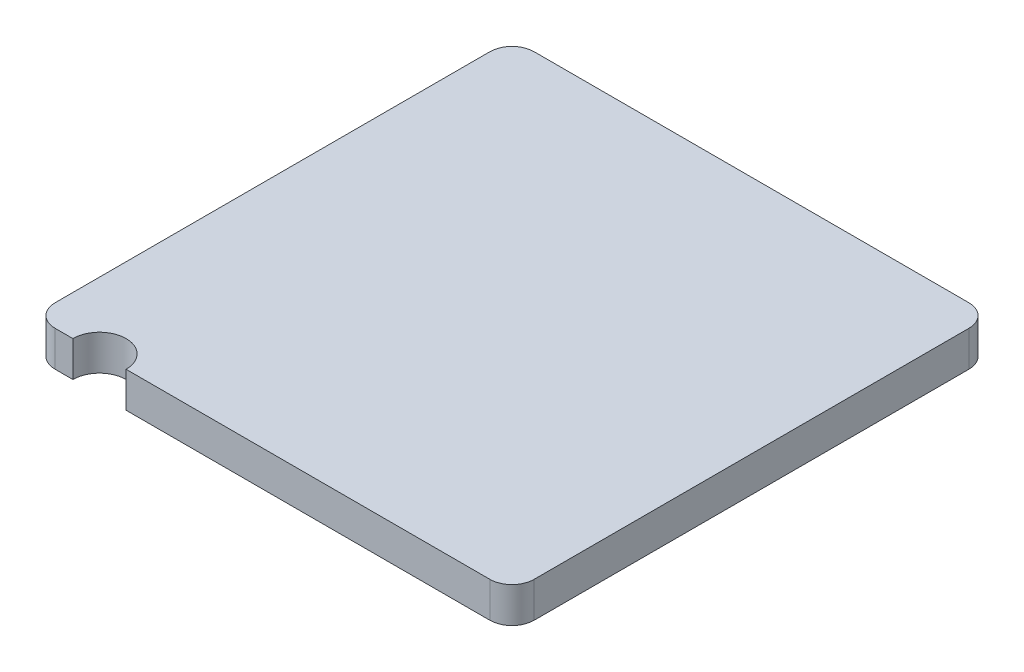
ISO-10303-21;
HEADER;
FILE_DESCRIPTION(('STEP AP214'),'2;1');
FILE_NAME('part.step','',(''),(''),'','','');
FILE_SCHEMA(('AUTOMOTIVE_DESIGN { 1 0 10303 214 1 1 1 1 }'));
ENDSEC;
DATA;
#1=APPLICATION_CONTEXT('core data for automotive mechanical design processes');
#2=APPLICATION_PROTOCOL_DEFINITION('international standard','automotive_design',2000,#1);
#3=PRODUCT_CONTEXT('',#1,'mechanical');
#4=PRODUCT('Part','Part','',(#3));
#5=PRODUCT_RELATED_PRODUCT_CATEGORY('part','',(#4));
#6=PRODUCT_DEFINITION_FORMATION('','',#4);
#7=PRODUCT_DEFINITION_CONTEXT('part definition',#1,'design');
#8=PRODUCT_DEFINITION('design','',#6,#7);
#9=PRODUCT_DEFINITION_SHAPE('','',#8);
#10=(LENGTH_UNIT() NAMED_UNIT(*) SI_UNIT(.MILLI.,.METRE.));
#11=(NAMED_UNIT(*) PLANE_ANGLE_UNIT() SI_UNIT($,.RADIAN.));
#12=(NAMED_UNIT(*) SI_UNIT($,.STERADIAN.) SOLID_ANGLE_UNIT());
#13=UNCERTAINTY_MEASURE_WITH_UNIT(LENGTH_MEASURE(1.E-05),#10,'distance_accuracy_value','');
#14=(GEOMETRIC_REPRESENTATION_CONTEXT(3) GLOBAL_UNCERTAINTY_ASSIGNED_CONTEXT((#13)) GLOBAL_UNIT_ASSIGNED_CONTEXT((#10,
#11,#12)) REPRESENTATION_CONTEXT('',''));
#15=CARTESIAN_POINT('',(0.,0.,0.));
#16=DIRECTION('',(0.,0.,1.));
#17=DIRECTION('',(1.,0.,0.));
#18=AXIS2_PLACEMENT_3D('',#15,#16,#17);
#19=CARTESIAN_POINT('',(-1.35,0.2,1.35));
#20=DIRECTION('',(0.,0.,-1.));
#21=DIRECTION('',(-1.,0.,0.));
#22=AXIS2_PLACEMENT_3D('',#19,#20,#21);
#23=PLANE('',#22);
#24=DIRECTION('',(1.,0.,0.));
#25=VECTOR('',#24,1.);
#26=CARTESIAN_POINT('',(-1.35,0.2,1.35));
#27=LINE('',#26,#25);
#28=CARTESIAN_POINT('',(-0.825,0.2,1.35));
#29=VERTEX_POINT('',#28);
#30=CARTESIAN_POINT('',(1.225,0.2,1.35));
#31=VERTEX_POINT('',#30);
#32=EDGE_CURVE('E57',#29,#31,#27,.T.);
#33=ORIENTED_EDGE('',*,*,#32,.F.);
#34=DIRECTION('',(0.,-1.,0.));
#35=VECTOR('',#34,1.);
#36=CARTESIAN_POINT('',(-0.825,0.2,1.35));
#37=LINE('',#36,#35);
#38=CARTESIAN_POINT('',(-0.825,0.,1.35));
#39=VERTEX_POINT('',#38);
#40=EDGE_CURVE('E109',#29,#39,#37,.T.);
#41=ORIENTED_EDGE('',*,*,#40,.T.);
#42=DIRECTION('',(1.,0.,0.));
#43=VECTOR('',#42,1.);
#44=CARTESIAN_POINT('',(-1.35,0.,1.35));
#45=LINE('',#44,#43);
#46=CARTESIAN_POINT('',(1.225,0.,1.35));
#47=VERTEX_POINT('',#46);
#48=EDGE_CURVE('E140',#39,#47,#45,.T.);
#49=ORIENTED_EDGE('',*,*,#48,.T.);
#50=DIRECTION('',(0.,-1.,0.));
#51=VECTOR('',#50,1.);
#52=CARTESIAN_POINT('',(1.225,0.2,1.35));
#53=LINE('',#52,#51);
#54=EDGE_CURVE('E11',#47,#31,#53,.F.);
#55=ORIENTED_EDGE('',*,*,#54,.T.);
#56=EDGE_LOOP('',(#33,#41,#49,#55));
#57=FACE_BOUND('',#56,.T.);
#58=ADVANCED_FACE('F34',(#57),#23,.F.);
#59=CARTESIAN_POINT('',(1.35,0.2,1.35));
#60=DIRECTION('',(-1.,0.,0.));
#61=DIRECTION('',(0.,0.,1.));
#62=AXIS2_PLACEMENT_3D('',#59,#60,#61);
#63=PLANE('',#62);
#64=DIRECTION('',(0.,0.,-1.));
#65=VECTOR('',#64,1.);
#66=CARTESIAN_POINT('',(1.35,0.,1.35));
#67=LINE('',#66,#65);
#68=CARTESIAN_POINT('',(1.35,0.,1.225));
#69=VERTEX_POINT('',#68);
#70=CARTESIAN_POINT('',(1.35,0.,-1.225));
#71=VERTEX_POINT('',#70);
#72=EDGE_CURVE('E131',#69,#71,#67,.T.);
#73=ORIENTED_EDGE('',*,*,#72,.T.);
#74=DIRECTION('',(0.,-1.,0.));
#75=VECTOR('',#74,1.);
#76=CARTESIAN_POINT('',(1.35,0.2,-1.225));
#77=LINE('',#76,#75);
#78=CARTESIAN_POINT('',(1.35,0.2,-1.225));
#79=VERTEX_POINT('',#78);
#80=EDGE_CURVE('E174',#71,#79,#77,.F.);
#81=ORIENTED_EDGE('',*,*,#80,.T.);
#82=DIRECTION('',(0.,0.,-1.));
#83=VECTOR('',#82,1.);
#84=CARTESIAN_POINT('',(1.35,0.2,1.35));
#85=LINE('',#84,#83);
#86=CARTESIAN_POINT('',(1.35,0.2,1.225));
#87=VERTEX_POINT('',#86);
#88=EDGE_CURVE('E144',#87,#79,#85,.T.);
#89=ORIENTED_EDGE('',*,*,#88,.F.);
#90=DIRECTION('',(0.,-1.,0.));
#91=VECTOR('',#90,1.);
#92=CARTESIAN_POINT('',(1.35,0.2,1.225));
#93=LINE('',#92,#91);
#94=EDGE_CURVE('E171',#87,#69,#93,.T.);
#95=ORIENTED_EDGE('',*,*,#94,.T.);
#96=EDGE_LOOP('',(#73,#81,#89,#95));
#97=FACE_BOUND('',#96,.T.);
#98=ADVANCED_FACE('F210',(#97),#63,.F.);
#99=CARTESIAN_POINT('',(-1.35,0.2,-1.35));
#100=DIRECTION('',(0.,0.,1.));
#101=DIRECTION('',(1.,0.,0.));
#102=AXIS2_PLACEMENT_3D('',#99,#100,#101);
#103=PLANE('',#102);
#104=DIRECTION('',(-1.,0.,0.));
#105=VECTOR('',#104,1.);
#106=CARTESIAN_POINT('',(-1.35,0.,-1.35));
#107=LINE('',#106,#105);
#108=CARTESIAN_POINT('',(1.225,0.,-1.35));
#109=VERTEX_POINT('',#108);
#110=CARTESIAN_POINT('',(-1.225,0.,-1.35));
#111=VERTEX_POINT('',#110);
#112=EDGE_CURVE('E134',#109,#111,#107,.T.);
#113=ORIENTED_EDGE('',*,*,#112,.T.);
#114=DIRECTION('',(0.,-1.,0.));
#115=VECTOR('',#114,1.);
#116=CARTESIAN_POINT('',(-1.225,0.2,-1.35));
#117=LINE('',#116,#115);
#118=CARTESIAN_POINT('',(-1.225,0.2,-1.35));
#119=VERTEX_POINT('',#118);
#120=EDGE_CURVE('E161',#111,#119,#117,.F.);
#121=ORIENTED_EDGE('',*,*,#120,.T.);
#122=DIRECTION('',(-1.,0.,0.));
#123=VECTOR('',#122,1.);
#124=CARTESIAN_POINT('',(-1.35,0.2,-1.35));
#125=LINE('',#124,#123);
#126=CARTESIAN_POINT('',(1.225,0.2,-1.35));
#127=VERTEX_POINT('',#126);
#128=EDGE_CURVE('E127',#127,#119,#125,.T.);
#129=ORIENTED_EDGE('',*,*,#128,.F.);
#130=DIRECTION('',(0.,-1.,0.));
#131=VECTOR('',#130,1.);
#132=CARTESIAN_POINT('',(1.225,0.2,-1.35));
#133=LINE('',#132,#131);
#134=EDGE_CURVE('E158',#127,#109,#133,.T.);
#135=ORIENTED_EDGE('',*,*,#134,.T.);
#136=EDGE_LOOP('',(#113,#121,#129,#135));
#137=FACE_BOUND('',#136,.T.);
#138=ADVANCED_FACE('F204',(#137),#103,.F.);
#139=CARTESIAN_POINT('',(-1.35,0.2,1.35));
#140=DIRECTION('',(1.,0.,0.));
#141=DIRECTION('',(0.,0.,-1.));
#142=AXIS2_PLACEMENT_3D('',#139,#140,#141);
#143=PLANE('',#142);
#144=DIRECTION('',(0.,0.,1.));
#145=VECTOR('',#144,1.);
#146=CARTESIAN_POINT('',(-1.35,0.2,1.35));
#147=LINE('',#146,#145);
#148=CARTESIAN_POINT('',(-1.35,0.2,-1.225));
#149=VERTEX_POINT('',#148);
#150=CARTESIAN_POINT('',(-1.35,0.2,1.225));
#151=VERTEX_POINT('',#150);
#152=EDGE_CURVE('E123',#149,#151,#147,.T.);
#153=ORIENTED_EDGE('',*,*,#152,.F.);
#154=DIRECTION('',(0.,-1.,0.));
#155=VECTOR('',#154,1.);
#156=CARTESIAN_POINT('',(-1.35,0.2,-1.225));
#157=LINE('',#156,#155);
#158=CARTESIAN_POINT('',(-1.35,0.,-1.225));
#159=VERTEX_POINT('',#158);
#160=EDGE_CURVE('E146',#149,#159,#157,.T.);
#161=ORIENTED_EDGE('',*,*,#160,.T.);
#162=DIRECTION('',(0.,0.,1.));
#163=VECTOR('',#162,1.);
#164=CARTESIAN_POINT('',(-1.35,0.,1.35));
#165=LINE('',#164,#163);
#166=CARTESIAN_POINT('',(-1.35,0.,1.225));
#167=VERTEX_POINT('',#166);
#168=EDGE_CURVE('E137',#159,#167,#165,.T.);
#169=ORIENTED_EDGE('',*,*,#168,.T.);
#170=DIRECTION('',(0.,-1.,0.));
#171=VECTOR('',#170,1.);
#172=CARTESIAN_POINT('',(-1.35,0.2,1.225));
#173=LINE('',#172,#171);
#174=EDGE_CURVE('E125',#167,#151,#173,.F.);
#175=ORIENTED_EDGE('',*,*,#174,.T.);
#176=EDGE_LOOP('',(#153,#161,#169,#175));
#177=FACE_BOUND('',#176,.T.);
#178=ADVANCED_FACE('F201',(#177),#143,.F.);
#179=CARTESIAN_POINT('',(-1.225,0.,1.35));
#180=VERTEX_POINT('',#179);
#181=CARTESIAN_POINT('',(-1.125,0.,1.35));
#182=VERTEX_POINT('',#181);
#183=EDGE_CURVE('E141',#180,#182,#45,.T.);
#184=ORIENTED_EDGE('',*,*,#183,.T.);
#185=DIRECTION('',(0.,-1.,0.));
#186=VECTOR('',#185,1.);
#187=CARTESIAN_POINT('',(-1.125,0.2,1.35));
#188=LINE('',#187,#186);
#189=CARTESIAN_POINT('',(-1.125,0.2,1.35));
#190=VERTEX_POINT('',#189);
#191=EDGE_CURVE('E49',#190,#182,#188,.T.);
#192=ORIENTED_EDGE('',*,*,#191,.F.);
#193=CARTESIAN_POINT('',(-1.225,0.2,1.35));
#194=VERTEX_POINT('',#193);
#195=EDGE_CURVE('E119',#194,#190,#27,.T.);
#196=ORIENTED_EDGE('',*,*,#195,.F.);
#197=DIRECTION('',(0.,-1.,0.));
#198=VECTOR('',#197,1.);
#199=CARTESIAN_POINT('',(-1.225,0.2,1.35));
#200=LINE('',#199,#198);
#201=EDGE_CURVE('E42',#194,#180,#200,.T.);
#202=ORIENTED_EDGE('',*,*,#201,.T.);
#203=EDGE_LOOP('',(#184,#192,#196,#202));
#204=FACE_BOUND('',#203,.T.);
#205=ADVANCED_FACE('F179',(#204),#23,.F.);
#206=CARTESIAN_POINT('',(0.,0.2,0.));
#207=DIRECTION('',(0.,-1.,0.));
#208=DIRECTION('',(0.,0.,-1.));
#209=AXIS2_PLACEMENT_3D('',#206,#207,#208);
#210=PLANE('',#209);
#211=ORIENTED_EDGE('',*,*,#195,.T.);
#212=CARTESIAN_POINT('',(-0.975,0.2,1.35));
#213=DIRECTION('',(0.,-1.,0.));
#214=DIRECTION('',(0.,0.,-1.));
#215=AXIS2_PLACEMENT_3D('',#212,#213,#214);
#216=CIRCLE('',#215,0.15);
#217=EDGE_CURVE('E111',#190,#29,#216,.T.);
#218=ORIENTED_EDGE('',*,*,#217,.T.);
#219=ORIENTED_EDGE('',*,*,#32,.T.);
#220=CARTESIAN_POINT('',(1.225,0.2,1.225));
#221=DIRECTION('',(0.,-1.,0.));
#222=DIRECTION('',(0.,0.,-1.));
#223=AXIS2_PLACEMENT_3D('',#220,#221,#222);
#224=CIRCLE('',#223,0.125);
#225=EDGE_CURVE('E165',#31,#87,#224,.F.);
#226=ORIENTED_EDGE('',*,*,#225,.T.);
#227=ORIENTED_EDGE('',*,*,#88,.T.);
#228=CARTESIAN_POINT('',(1.225,0.2,-1.225));
#229=DIRECTION('',(0.,-1.,0.));
#230=DIRECTION('',(0.,0.,-1.));
#231=AXIS2_PLACEMENT_3D('',#228,#229,#230);
#232=CIRCLE('',#231,0.125);
#233=EDGE_CURVE('E167',#79,#127,#232,.F.);
#234=ORIENTED_EDGE('',*,*,#233,.T.);
#235=ORIENTED_EDGE('',*,*,#128,.T.);
#236=CARTESIAN_POINT('',(-1.225,0.2,-1.225));
#237=DIRECTION('',(0.,-1.,0.));
#238=DIRECTION('',(0.,0.,-1.));
#239=AXIS2_PLACEMENT_3D('',#236,#237,#238);
#240=CIRCLE('',#239,0.125);
#241=EDGE_CURVE('E169',#119,#149,#240,.F.);
#242=ORIENTED_EDGE('',*,*,#241,.T.);
#243=ORIENTED_EDGE('',*,*,#152,.T.);
#244=CARTESIAN_POINT('',(-1.225,0.2,1.225));
#245=DIRECTION('',(0.,-1.,0.));
#246=DIRECTION('',(0.,0.,-1.));
#247=AXIS2_PLACEMENT_3D('',#244,#245,#246);
#248=CIRCLE('',#247,0.125);
#249=EDGE_CURVE('E163',#151,#194,#248,.F.);
#250=ORIENTED_EDGE('',*,*,#249,.T.);
#251=EDGE_LOOP('',(#211,#218,#219,#226,#227,#234,#235,#242,#243,#250));
#252=FACE_BOUND('',#251,.T.);
#253=ADVANCED_FACE('F117',(#252),#210,.F.);
#254=CARTESIAN_POINT('',(0.,0.,0.));
#255=DIRECTION('',(0.,-1.,0.));
#256=DIRECTION('',(0.,0.,-1.));
#257=AXIS2_PLACEMENT_3D('',#254,#255,#256);
#258=PLANE('',#257);
#259=CARTESIAN_POINT('',(-0.975,0.,1.35));
#260=DIRECTION('',(0.,-1.,0.));
#261=DIRECTION('',(0.,0.,-1.));
#262=AXIS2_PLACEMENT_3D('',#259,#260,#261);
#263=CIRCLE('',#262,0.15);
#264=EDGE_CURVE('E112',#182,#39,#263,.T.);
#265=ORIENTED_EDGE('',*,*,#264,.F.);
#266=ORIENTED_EDGE('',*,*,#183,.F.);
#267=CARTESIAN_POINT('',(-1.225,0.,1.225));
#268=DIRECTION('',(0.,-1.,0.));
#269=DIRECTION('',(0.,0.,-1.));
#270=AXIS2_PLACEMENT_3D('',#267,#268,#269);
#271=CIRCLE('',#270,0.125);
#272=EDGE_CURVE('E149',#180,#167,#271,.T.);
#273=ORIENTED_EDGE('',*,*,#272,.T.);
#274=ORIENTED_EDGE('',*,*,#168,.F.);
#275=CARTESIAN_POINT('',(-1.225,0.,-1.225));
#276=DIRECTION('',(0.,-1.,0.));
#277=DIRECTION('',(0.,0.,-1.));
#278=AXIS2_PLACEMENT_3D('',#275,#276,#277);
#279=CIRCLE('',#278,0.125);
#280=EDGE_CURVE('E156',#159,#111,#279,.T.);
#281=ORIENTED_EDGE('',*,*,#280,.T.);
#282=ORIENTED_EDGE('',*,*,#112,.F.);
#283=CARTESIAN_POINT('',(1.225,0.,-1.225));
#284=DIRECTION('',(0.,-1.,0.));
#285=DIRECTION('',(0.,0.,-1.));
#286=AXIS2_PLACEMENT_3D('',#283,#284,#285);
#287=CIRCLE('',#286,0.125);
#288=EDGE_CURVE('E154',#109,#71,#287,.T.);
#289=ORIENTED_EDGE('',*,*,#288,.T.);
#290=ORIENTED_EDGE('',*,*,#72,.F.);
#291=CARTESIAN_POINT('',(1.225,0.,1.225));
#292=DIRECTION('',(0.,-1.,0.));
#293=DIRECTION('',(0.,0.,-1.));
#294=AXIS2_PLACEMENT_3D('',#291,#292,#293);
#295=CIRCLE('',#294,0.125);
#296=EDGE_CURVE('E151',#69,#47,#295,.T.);
#297=ORIENTED_EDGE('',*,*,#296,.T.);
#298=ORIENTED_EDGE('',*,*,#48,.F.);
#299=EDGE_LOOP('',(#265,#266,#273,#274,#281,#282,#289,#290,#297,#298));
#300=FACE_BOUND('',#299,.T.);
#301=ADVANCED_FACE('F183',(#300),#258,.T.);
#302=CARTESIAN_POINT('',(-1.225,0.2,-1.225));
#303=DIRECTION('',(0.,-1.,0.));
#304=DIRECTION('',(0.,0.,-1.));
#305=AXIS2_PLACEMENT_3D('',#302,#303,#304);
#306=CYLINDRICAL_SURFACE('',#305,0.125);
#307=ORIENTED_EDGE('',*,*,#241,.F.);
#308=ORIENTED_EDGE('',*,*,#120,.F.);
#309=ORIENTED_EDGE('',*,*,#280,.F.);
#310=ORIENTED_EDGE('',*,*,#160,.F.);
#311=EDGE_LOOP('',(#307,#308,#309,#310));
#312=FACE_BOUND('',#311,.T.);
#313=ADVANCED_FACE('F199',(#312),#306,.T.);
#314=CARTESIAN_POINT('',(1.225,0.2,-1.225));
#315=DIRECTION('',(0.,-1.,0.));
#316=DIRECTION('',(0.,0.,-1.));
#317=AXIS2_PLACEMENT_3D('',#314,#315,#316);
#318=CYLINDRICAL_SURFACE('',#317,0.125);
#319=ORIENTED_EDGE('',*,*,#233,.F.);
#320=ORIENTED_EDGE('',*,*,#80,.F.);
#321=ORIENTED_EDGE('',*,*,#288,.F.);
#322=ORIENTED_EDGE('',*,*,#134,.F.);
#323=EDGE_LOOP('',(#319,#320,#321,#322));
#324=FACE_BOUND('',#323,.T.);
#325=ADVANCED_FACE('F206',(#324),#318,.T.);
#326=CARTESIAN_POINT('',(1.225,0.2,1.225));
#327=DIRECTION('',(0.,-1.,0.));
#328=DIRECTION('',(0.,0.,-1.));
#329=AXIS2_PLACEMENT_3D('',#326,#327,#328);
#330=CYLINDRICAL_SURFACE('',#329,0.125);
#331=ORIENTED_EDGE('',*,*,#225,.F.);
#332=ORIENTED_EDGE('',*,*,#54,.F.);
#333=ORIENTED_EDGE('',*,*,#296,.F.);
#334=ORIENTED_EDGE('',*,*,#94,.F.);
#335=EDGE_LOOP('',(#331,#332,#333,#334));
#336=FACE_BOUND('',#335,.T.);
#337=ADVANCED_FACE('F214',(#336),#330,.T.);
#338=CARTESIAN_POINT('',(-1.225,0.2,1.225));
#339=DIRECTION('',(0.,-1.,0.));
#340=DIRECTION('',(0.,0.,-1.));
#341=AXIS2_PLACEMENT_3D('',#338,#339,#340);
#342=CYLINDRICAL_SURFACE('',#341,0.125);
#343=ORIENTED_EDGE('',*,*,#249,.F.);
#344=ORIENTED_EDGE('',*,*,#174,.F.);
#345=ORIENTED_EDGE('',*,*,#272,.F.);
#346=ORIENTED_EDGE('',*,*,#201,.F.);
#347=EDGE_LOOP('',(#343,#344,#345,#346));
#348=FACE_BOUND('',#347,.T.);
#349=ADVANCED_FACE('F36',(#348),#342,.T.);
#350=CARTESIAN_POINT('',(-0.975,0.2,1.35));
#351=DIRECTION('',(0.,-1.,0.));
#352=DIRECTION('',(0.,0.,-1.));
#353=AXIS2_PLACEMENT_3D('',#350,#351,#352);
#354=CYLINDRICAL_SURFACE('',#353,0.15);
#355=ORIENTED_EDGE('',*,*,#264,.T.);
#356=ORIENTED_EDGE('',*,*,#40,.F.);
#357=ORIENTED_EDGE('',*,*,#217,.F.);
#358=ORIENTED_EDGE('',*,*,#191,.T.);
#359=EDGE_LOOP('',(#355,#356,#357,#358));
#360=FACE_BOUND('',#359,.T.);
#361=ADVANCED_FACE('F110',(#360),#354,.F.);
#362=CLOSED_SHELL('',(#58,#98,#138,#178,#205,#253,#301,#313,#325,#337,#349,#361));
#363=MANIFOLD_SOLID_BREP('B2',#362);
#364=ADVANCED_BREP_SHAPE_REPRESENTATION('',(#18,#363),#14);
#365=SHAPE_DEFINITION_REPRESENTATION(#9,#364);
ENDSEC;
END-ISO-10303-21;
